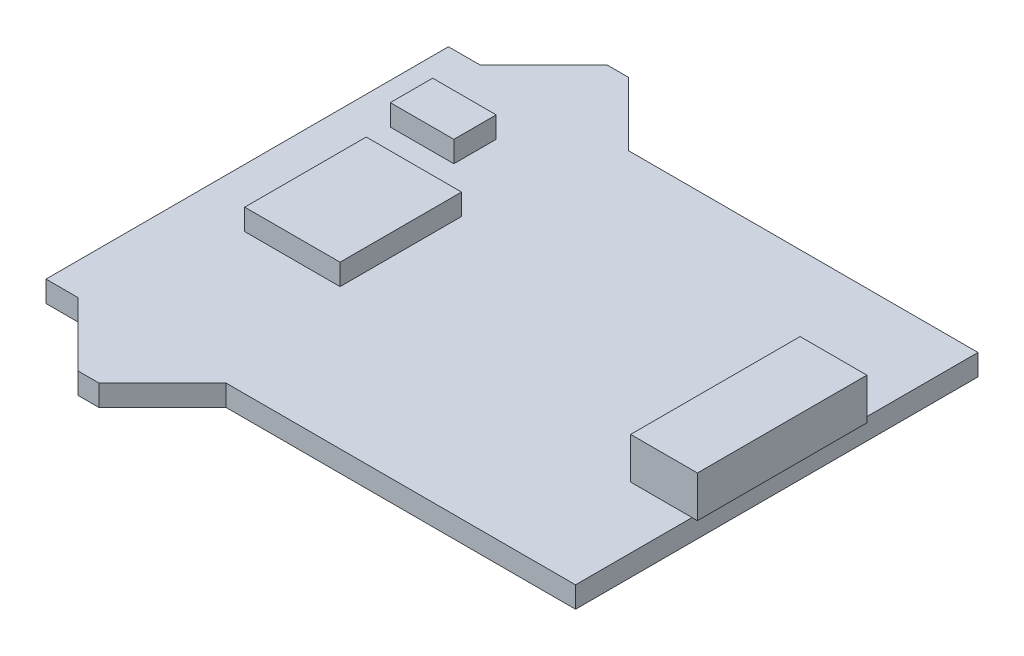
ISO-10303-21;
HEADER;
FILE_DESCRIPTION(('STEP AP214'),'2;1');
FILE_NAME('part.step','',(''),(''),'','','');
FILE_SCHEMA(('AUTOMOTIVE_DESIGN { 1 0 10303 214 1 1 1 1 }'));
ENDSEC;
DATA;
#1=APPLICATION_CONTEXT('core data for automotive mechanical design processes');
#2=APPLICATION_PROTOCOL_DEFINITION('international standard','automotive_design',2000,#1);
#3=PRODUCT_CONTEXT('',#1,'mechanical');
#4=PRODUCT('Part','Part','',(#3));
#5=PRODUCT_RELATED_PRODUCT_CATEGORY('part','',(#4));
#6=PRODUCT_DEFINITION_FORMATION('','',#4);
#7=PRODUCT_DEFINITION_CONTEXT('part definition',#1,'design');
#8=PRODUCT_DEFINITION('design','',#6,#7);
#9=PRODUCT_DEFINITION_SHAPE('','',#8);
#10=(LENGTH_UNIT() NAMED_UNIT(*) SI_UNIT(.MILLI.,.METRE.));
#11=(NAMED_UNIT(*) PLANE_ANGLE_UNIT() SI_UNIT($,.RADIAN.));
#12=(NAMED_UNIT(*) SI_UNIT($,.STERADIAN.) SOLID_ANGLE_UNIT());
#13=UNCERTAINTY_MEASURE_WITH_UNIT(LENGTH_MEASURE(1.E-05),#10,'distance_accuracy_value','');
#14=(GEOMETRIC_REPRESENTATION_CONTEXT(3) GLOBAL_UNCERTAINTY_ASSIGNED_CONTEXT((#13)) GLOBAL_UNIT_ASSIGNED_CONTEXT((#10,
#11,#12)) REPRESENTATION_CONTEXT('',''));
#15=CARTESIAN_POINT('',(0.,0.,0.));
#16=DIRECTION('',(0.,0.,1.));
#17=DIRECTION('',(1.,0.,0.));
#18=AXIS2_PLACEMENT_3D('',#15,#16,#17);
#19=CARTESIAN_POINT('',(0.,0.,0.));
#20=DIRECTION('',(0.,-1.,0.));
#21=DIRECTION('',(0.,0.,-1.));
#22=AXIS2_PLACEMENT_3D('',#19,#20,#21);
#23=PLANE('',#22);
#24=DIRECTION('',(0.,0.,-1.));
#25=VECTOR('',#24,1.);
#26=CARTESIAN_POINT('',(-0.0875000000000005,0.,-4.842));
#27=LINE('',#26,#25);
#28=CARTESIAN_POINT('',(-0.0875000000000005,0.,-4.842));
#29=VERTEX_POINT('',#28);
#30=CARTESIAN_POINT('',(-0.0875000000000008,0.,-6.842));
#31=VERTEX_POINT('',#30);
#32=EDGE_CURVE('E226',#29,#31,#27,.T.);
#33=ORIENTED_EDGE('',*,*,#32,.F.);
#34=DIRECTION('',(1.,0.,0.));
#35=VECTOR('',#34,1.);
#36=CARTESIAN_POINT('',(-3.0875,0.,-4.842));
#37=LINE('',#36,#35);
#38=CARTESIAN_POINT('',(-3.0875,0.,-4.842));
#39=VERTEX_POINT('',#38);
#40=EDGE_CURVE('E239',#39,#29,#37,.T.);
#41=ORIENTED_EDGE('',*,*,#40,.F.);
#42=DIRECTION('',(0.,0.,1.));
#43=VECTOR('',#42,1.);
#44=CARTESIAN_POINT('',(-3.0875,0.,-4.842));
#45=LINE('',#44,#43);
#46=CARTESIAN_POINT('',(-3.0875,0.,-6.842));
#47=VERTEX_POINT('',#46);
#48=EDGE_CURVE('E248',#47,#39,#45,.T.);
#49=ORIENTED_EDGE('',*,*,#48,.F.);
#50=DIRECTION('',(-1.,0.,0.));
#51=VECTOR('',#50,1.);
#52=CARTESIAN_POINT('',(-3.0875,0.,-6.842));
#53=LINE('',#52,#51);
#54=EDGE_CURVE('E229',#31,#47,#53,.T.);
#55=ORIENTED_EDGE('',*,*,#54,.F.);
#56=EDGE_LOOP('',(#33,#41,#49,#55));
#57=FACE_BOUND('',#56,.T.);
#58=DIRECTION('',(0.,0.,-1.));
#59=VECTOR('',#58,1.);
#60=CARTESIAN_POINT('',(2.249999945,0.,2.86760421207147));
#61=LINE('',#60,#59);
#62=CARTESIAN_POINT('',(2.249999945,0.,2.86760421207147));
#63=VERTEX_POINT('',#62);
#64=CARTESIAN_POINT('',(2.249999945,0.,-2.86760421207147));
#65=VERTEX_POINT('',#64);
#66=EDGE_CURVE('E264',#63,#65,#61,.T.);
#67=ORIENTED_EDGE('',*,*,#66,.F.);
#68=DIRECTION('',(1.,0.,0.));
#69=VECTOR('',#68,1.);
#70=CARTESIAN_POINT('',(-2.249999945,0.,2.86760421207147));
#71=LINE('',#70,#69);
#72=CARTESIAN_POINT('',(-2.249999945,0.,2.86760421207147));
#73=VERTEX_POINT('',#72);
#74=EDGE_CURVE('E269',#73,#63,#71,.T.);
#75=ORIENTED_EDGE('',*,*,#74,.F.);
#76=DIRECTION('',(0.,0.,1.));
#77=VECTOR('',#76,1.);
#78=CARTESIAN_POINT('',(-2.249999945,0.,2.86760421207147));
#79=LINE('',#78,#77);
#80=CARTESIAN_POINT('',(-2.249999945,0.,-2.86760421207147));
#81=VERTEX_POINT('',#80);
#82=EDGE_CURVE('E281',#81,#73,#79,.T.);
#83=ORIENTED_EDGE('',*,*,#82,.F.);
#84=DIRECTION('',(-1.,0.,0.));
#85=VECTOR('',#84,1.);
#86=CARTESIAN_POINT('',(-2.249999945,0.,-2.86760421207147));
#87=LINE('',#86,#85);
#88=EDGE_CURVE('E278',#65,#81,#87,.T.);
#89=ORIENTED_EDGE('',*,*,#88,.F.);
#90=EDGE_LOOP('',(#67,#75,#83,#89));
#91=FACE_BOUND('',#90,.T.);
#92=DIRECTION('',(1.,0.,0.));
#93=VECTOR('',#92,1.);
#94=CARTESIAN_POINT('',(17.10000009,0.,4.000000001));
#95=LINE('',#94,#93);
#96=CARTESIAN_POINT('',(17.10000009,0.,4.000000001));
#97=VERTEX_POINT('',#96);
#98=CARTESIAN_POINT('',(20.000000132,0.,4.000000001));
#99=VERTEX_POINT('',#98);
#100=EDGE_CURVE('E50',#97,#99,#95,.T.);
#101=ORIENTED_EDGE('',*,*,#100,.F.);
#102=DIRECTION('',(0.,0.,1.));
#103=VECTOR('',#102,1.);
#104=CARTESIAN_POINT('',(17.10000009,0.,4.000000001));
#105=LINE('',#104,#103);
#106=CARTESIAN_POINT('',(17.10000009,0.,-4.000000001));
#107=VERTEX_POINT('',#106);
#108=EDGE_CURVE('E54',#107,#97,#105,.T.);
#109=ORIENTED_EDGE('',*,*,#108,.F.);
#110=DIRECTION('',(-1.,0.,0.));
#111=VECTOR('',#110,1.);
#112=CARTESIAN_POINT('',(17.10000009,0.,-4.000000001));
#113=LINE('',#112,#111);
#114=CARTESIAN_POINT('',(20.000000132,0.,-4.000000001));
#115=VERTEX_POINT('',#114);
#116=EDGE_CURVE('E395',#115,#107,#113,.T.);
#117=ORIENTED_EDGE('',*,*,#116,.F.);
#118=DIRECTION('',(0.,0.,-1.));
#119=VECTOR('',#118,1.);
#120=CARTESIAN_POINT('',(20.000000132,0.,-9.50000005));
#121=LINE('',#120,#119);
#122=CARTESIAN_POINT('',(20.000000132,0.,-9.50000005));
#123=VERTEX_POINT('',#122);
#124=EDGE_CURVE('E365',#115,#123,#121,.T.);
#125=ORIENTED_EDGE('',*,*,#124,.T.);
#126=DIRECTION('',(-1.,0.,0.));
#127=VECTOR('',#126,1.);
#128=CARTESIAN_POINT('',(3.499999985,0.,-9.50000005));
#129=LINE('',#128,#127);
#130=CARTESIAN_POINT('',(3.499999985,0.,-9.50000005));
#131=VERTEX_POINT('',#130);
#132=EDGE_CURVE('E297',#123,#131,#129,.T.);
#133=ORIENTED_EDGE('',*,*,#132,.T.);
#134=DIRECTION('',(-0.707106781186547,0.,-0.707106781186547));
#135=VECTOR('',#134,1.);
#136=CARTESIAN_POINT('',(0.499999888999999,0.,-12.500000146));
#137=LINE('',#136,#135);
#138=CARTESIAN_POINT('',(0.499999888999999,0.,-12.500000146));
#139=VERTEX_POINT('',#138);
#140=EDGE_CURVE('E335',#131,#139,#137,.T.);
#141=ORIENTED_EDGE('',*,*,#140,.T.);
#142=DIRECTION('',(-1.,0.,0.));
#143=VECTOR('',#142,1.);
#144=CARTESIAN_POINT('',(-0.499999888999999,0.,-12.500000146));
#145=LINE('',#144,#143);
#146=CARTESIAN_POINT('',(-0.499999888999999,0.,-12.500000146));
#147=VERTEX_POINT('',#146);
#148=EDGE_CURVE('E338',#139,#147,#145,.T.);
#149=ORIENTED_EDGE('',*,*,#148,.T.);
#150=DIRECTION('',(-0.707106781186547,0.,0.707106781186547));
#151=VECTOR('',#150,1.);
#152=CARTESIAN_POINT('',(-3.499999985,0.,-9.50000005));
#153=LINE('',#152,#151);
#154=CARTESIAN_POINT('',(-3.499999985,0.,-9.50000005));
#155=VERTEX_POINT('',#154);
#156=EDGE_CURVE('E341',#147,#155,#153,.T.);
#157=ORIENTED_EDGE('',*,*,#156,.T.);
#158=DIRECTION('',(-1.,0.,0.));
#159=VECTOR('',#158,1.);
#160=CARTESIAN_POINT('',(-4.999999906,0.,-9.50000005));
#161=LINE('',#160,#159);
#162=CARTESIAN_POINT('',(-4.999999906,0.,-9.50000005));
#163=VERTEX_POINT('',#162);
#164=EDGE_CURVE('E344',#155,#163,#161,.T.);
#165=ORIENTED_EDGE('',*,*,#164,.T.);
#166=DIRECTION('',(0.,0.,1.));
#167=VECTOR('',#166,1.);
#168=CARTESIAN_POINT('',(-4.999999906,0.,-9.50000005));
#169=LINE('',#168,#167);
#170=CARTESIAN_POINT('',(-4.999999906,0.,9.50000005));
#171=VERTEX_POINT('',#170);
#172=EDGE_CURVE('E347',#163,#171,#169,.T.);
#173=ORIENTED_EDGE('',*,*,#172,.T.);
#174=DIRECTION('',(1.,0.,0.));
#175=VECTOR('',#174,1.);
#176=CARTESIAN_POINT('',(-4.999999906,0.,9.50000005));
#177=LINE('',#176,#175);
#178=CARTESIAN_POINT('',(-3.499999985,0.,9.50000005));
#179=VERTEX_POINT('',#178);
#180=EDGE_CURVE('E350',#171,#179,#177,.T.);
#181=ORIENTED_EDGE('',*,*,#180,.T.);
#182=DIRECTION('',(0.707106781186547,0.,0.707106781186547));
#183=VECTOR('',#182,1.);
#184=CARTESIAN_POINT('',(-3.499999985,0.,9.50000005));
#185=LINE('',#184,#183);
#186=CARTESIAN_POINT('',(-0.499999888999999,0.,12.500000146));
#187=VERTEX_POINT('',#186);
#188=EDGE_CURVE('E353',#179,#187,#185,.T.);
#189=ORIENTED_EDGE('',*,*,#188,.T.);
#190=DIRECTION('',(1.,0.,0.));
#191=VECTOR('',#190,1.);
#192=CARTESIAN_POINT('',(-0.499999888999999,0.,12.500000146));
#193=LINE('',#192,#191);
#194=CARTESIAN_POINT('',(0.499999888999999,0.,12.500000146));
#195=VERTEX_POINT('',#194);
#196=EDGE_CURVE('E356',#187,#195,#193,.T.);
#197=ORIENTED_EDGE('',*,*,#196,.T.);
#198=DIRECTION('',(0.707106781186547,0.,-0.707106781186547));
#199=VECTOR('',#198,1.);
#200=CARTESIAN_POINT('',(0.499999888999999,0.,12.500000146));
#201=LINE('',#200,#199);
#202=CARTESIAN_POINT('',(3.499999985,0.,9.50000005));
#203=VERTEX_POINT('',#202);
#204=EDGE_CURVE('E359',#195,#203,#201,.T.);
#205=ORIENTED_EDGE('',*,*,#204,.T.);
#206=DIRECTION('',(1.,0.,0.));
#207=VECTOR('',#206,1.);
#208=CARTESIAN_POINT('',(4.999999906,0.,9.50000005));
#209=LINE('',#208,#207);
#210=CARTESIAN_POINT('',(20.000000132,0.,9.50000005));
#211=VERTEX_POINT('',#210);
#212=EDGE_CURVE('E362',#203,#211,#209,.T.);
#213=ORIENTED_EDGE('',*,*,#212,.T.);
#214=EDGE_CURVE('E301',#211,#99,#121,.T.);
#215=ORIENTED_EDGE('',*,*,#214,.T.);
#216=EDGE_LOOP('',(#101,#109,#117,#125,#133,#141,#149,#157,#165,#173,#181,#189,#197,#205,#213,#215));
#217=FACE_BOUND('',#216,.T.);
#218=ADVANCED_FACE('F33',(#57,#91,#217),#23,.F.);
#219=CARTESIAN_POINT('',(20.000000132,-1.000000032,-9.50000005));
#220=DIRECTION('',(1.,0.,0.));
#221=DIRECTION('',(0.,0.,-1.));
#222=AXIS2_PLACEMENT_3D('',#219,#220,#221);
#223=PLANE('',#222);
#224=ORIENTED_EDGE('',*,*,#214,.F.);
#225=DIRECTION('',(0.,1.,0.));
#226=VECTOR('',#225,1.);
#227=CARTESIAN_POINT('',(20.000000132,-1.000000032,9.50000005));
#228=LINE('',#227,#226);
#229=CARTESIAN_POINT('',(20.000000132,-1.000000032,9.50000005));
#230=VERTEX_POINT('',#229);
#231=EDGE_CURVE('E42',#230,#211,#228,.T.);
#232=ORIENTED_EDGE('',*,*,#231,.F.);
#233=DIRECTION('',(0.,0.,-1.));
#234=VECTOR('',#233,1.);
#235=CARTESIAN_POINT('',(20.000000132,-1.000000032,-9.50000005));
#236=LINE('',#235,#234);
#237=CARTESIAN_POINT('',(20.000000132,-1.000000032,-9.50000005));
#238=VERTEX_POINT('',#237);
#239=EDGE_CURVE('E330',#230,#238,#236,.T.);
#240=ORIENTED_EDGE('',*,*,#239,.T.);
#241=DIRECTION('',(0.,1.,0.));
#242=VECTOR('',#241,1.);
#243=CARTESIAN_POINT('',(20.000000132,-1.000000032,-9.50000005));
#244=LINE('',#243,#242);
#245=EDGE_CURVE('E11',#238,#123,#244,.T.);
#246=ORIENTED_EDGE('',*,*,#245,.T.);
#247=ORIENTED_EDGE('',*,*,#124,.F.);
#248=EDGE_CURVE('E366',#99,#115,#121,.T.);
#249=ORIENTED_EDGE('',*,*,#248,.F.);
#250=EDGE_LOOP('',(#224,#232,#240,#246,#247,#249));
#251=FACE_BOUND('',#250,.T.);
#252=ADVANCED_FACE('F429',(#251),#223,.T.);
#253=CARTESIAN_POINT('',(4.999999906,-1.000000032,9.50000005));
#254=DIRECTION('',(0.,0.,1.));
#255=DIRECTION('',(1.,0.,0.));
#256=AXIS2_PLACEMENT_3D('',#253,#254,#255);
#257=PLANE('',#256);
#258=ORIENTED_EDGE('',*,*,#212,.F.);
#259=DIRECTION('',(0.,1.,0.));
#260=VECTOR('',#259,1.);
#261=CARTESIAN_POINT('',(3.499999985,-1.000000032,9.50000005));
#262=LINE('',#261,#260);
#263=CARTESIAN_POINT('',(3.499999985,-1.000000032,9.50000005));
#264=VERTEX_POINT('',#263);
#265=EDGE_CURVE('E369',#264,#203,#262,.T.);
#266=ORIENTED_EDGE('',*,*,#265,.F.);
#267=DIRECTION('',(1.,0.,0.));
#268=VECTOR('',#267,1.);
#269=CARTESIAN_POINT('',(3.499999985,-1.000000032,9.50000005));
#270=LINE('',#269,#268);
#271=EDGE_CURVE('E328',#264,#230,#270,.T.);
#272=ORIENTED_EDGE('',*,*,#271,.T.);
#273=ORIENTED_EDGE('',*,*,#231,.T.);
#274=EDGE_LOOP('',(#258,#266,#272,#273));
#275=FACE_BOUND('',#274,.T.);
#276=ADVANCED_FACE('F435',(#275),#257,.T.);
#277=CARTESIAN_POINT('',(0.499999888999999,-1.000000032,12.500000146));
#278=DIRECTION('',(0.707106781186547,0.,0.707106781186548));
#279=DIRECTION('',(0.707106781186548,0.,-0.707106781186547));
#280=AXIS2_PLACEMENT_3D('',#277,#278,#279);
#281=PLANE('',#280);
#282=ORIENTED_EDGE('',*,*,#204,.F.);
#283=DIRECTION('',(0.,1.,0.));
#284=VECTOR('',#283,1.);
#285=CARTESIAN_POINT('',(0.499999888999999,-1.000000032,12.500000146));
#286=LINE('',#285,#284);
#287=CARTESIAN_POINT('',(0.499999888999999,-1.000000032,12.500000146));
#288=VERTEX_POINT('',#287);
#289=EDGE_CURVE('E372',#288,#195,#286,.T.);
#290=ORIENTED_EDGE('',*,*,#289,.F.);
#291=DIRECTION('',(0.707106781186547,0.,-0.707106781186547));
#292=VECTOR('',#291,1.);
#293=CARTESIAN_POINT('',(0.499999888999999,-1.000000032,12.500000146));
#294=LINE('',#293,#292);
#295=EDGE_CURVE('E325',#288,#264,#294,.T.);
#296=ORIENTED_EDGE('',*,*,#295,.T.);
#297=ORIENTED_EDGE('',*,*,#265,.T.);
#298=EDGE_LOOP('',(#282,#290,#296,#297));
#299=FACE_BOUND('',#298,.T.);
#300=ADVANCED_FACE('F444',(#299),#281,.T.);
#301=CARTESIAN_POINT('',(-0.499999888999999,-1.000000032,12.500000146));
#302=DIRECTION('',(0.,0.,1.));
#303=DIRECTION('',(1.,0.,0.));
#304=AXIS2_PLACEMENT_3D('',#301,#302,#303);
#305=PLANE('',#304);
#306=ORIENTED_EDGE('',*,*,#196,.F.);
#307=DIRECTION('',(0.,1.,0.));
#308=VECTOR('',#307,1.);
#309=CARTESIAN_POINT('',(-0.499999888999999,-1.000000032,12.500000146));
#310=LINE('',#309,#308);
#311=CARTESIAN_POINT('',(-0.499999888999999,-1.000000032,12.500000146));
#312=VERTEX_POINT('',#311);
#313=EDGE_CURVE('E374',#312,#187,#310,.T.);
#314=ORIENTED_EDGE('',*,*,#313,.F.);
#315=DIRECTION('',(1.,0.,0.));
#316=VECTOR('',#315,1.);
#317=CARTESIAN_POINT('',(-0.499999888999999,-1.000000032,12.500000146));
#318=LINE('',#317,#316);
#319=EDGE_CURVE('E322',#312,#288,#318,.T.);
#320=ORIENTED_EDGE('',*,*,#319,.T.);
#321=ORIENTED_EDGE('',*,*,#289,.T.);
#322=EDGE_LOOP('',(#306,#314,#320,#321));
#323=FACE_BOUND('',#322,.T.);
#324=ADVANCED_FACE('F448',(#323),#305,.T.);
#325=CARTESIAN_POINT('',(-3.499999985,-1.000000032,9.50000005));
#326=DIRECTION('',(-0.707106781186547,0.,0.707106781186548));
#327=DIRECTION('',(0.707106781186548,0.,0.707106781186547));
#328=AXIS2_PLACEMENT_3D('',#325,#326,#327);
#329=PLANE('',#328);
#330=ORIENTED_EDGE('',*,*,#188,.F.);
#331=DIRECTION('',(0.,1.,0.));
#332=VECTOR('',#331,1.);
#333=CARTESIAN_POINT('',(-3.499999985,-1.000000032,9.50000005));
#334=LINE('',#333,#332);
#335=CARTESIAN_POINT('',(-3.499999985,-1.000000032,9.50000005));
#336=VERTEX_POINT('',#335);
#337=EDGE_CURVE('E376',#336,#179,#334,.T.);
#338=ORIENTED_EDGE('',*,*,#337,.F.);
#339=DIRECTION('',(0.707106781186547,0.,0.707106781186547));
#340=VECTOR('',#339,1.);
#341=CARTESIAN_POINT('',(-3.499999985,-1.000000032,9.50000005));
#342=LINE('',#341,#340);
#343=EDGE_CURVE('E319',#336,#312,#342,.T.);
#344=ORIENTED_EDGE('',*,*,#343,.T.);
#345=ORIENTED_EDGE('',*,*,#313,.T.);
#346=EDGE_LOOP('',(#330,#338,#344,#345));
#347=FACE_BOUND('',#346,.T.);
#348=ADVANCED_FACE('F452',(#347),#329,.T.);
#349=CARTESIAN_POINT('',(-4.999999906,-1.000000032,9.50000005));
#350=DIRECTION('',(0.,0.,1.));
#351=DIRECTION('',(1.,0.,0.));
#352=AXIS2_PLACEMENT_3D('',#349,#350,#351);
#353=PLANE('',#352);
#354=ORIENTED_EDGE('',*,*,#180,.F.);
#355=DIRECTION('',(0.,1.,0.));
#356=VECTOR('',#355,1.);
#357=CARTESIAN_POINT('',(-4.999999906,-1.000000032,9.50000005));
#358=LINE('',#357,#356);
#359=CARTESIAN_POINT('',(-4.999999906,-1.000000032,9.50000005));
#360=VERTEX_POINT('',#359);
#361=EDGE_CURVE('E378',#360,#171,#358,.T.);
#362=ORIENTED_EDGE('',*,*,#361,.F.);
#363=DIRECTION('',(1.,0.,0.));
#364=VECTOR('',#363,1.);
#365=CARTESIAN_POINT('',(-4.999999906,-1.000000032,9.50000005));
#366=LINE('',#365,#364);
#367=EDGE_CURVE('E316',#360,#336,#366,.T.);
#368=ORIENTED_EDGE('',*,*,#367,.T.);
#369=ORIENTED_EDGE('',*,*,#337,.T.);
#370=EDGE_LOOP('',(#354,#362,#368,#369));
#371=FACE_BOUND('',#370,.T.);
#372=ADVANCED_FACE('F456',(#371),#353,.T.);
#373=CARTESIAN_POINT('',(-4.999999906,-1.000000032,-9.50000005));
#374=DIRECTION('',(-1.,0.,0.));
#375=DIRECTION('',(0.,0.,1.));
#376=AXIS2_PLACEMENT_3D('',#373,#374,#375);
#377=PLANE('',#376);
#378=ORIENTED_EDGE('',*,*,#172,.F.);
#379=DIRECTION('',(0.,1.,0.));
#380=VECTOR('',#379,1.);
#381=CARTESIAN_POINT('',(-4.999999906,-1.000000032,-9.50000005));
#382=LINE('',#381,#380);
#383=CARTESIAN_POINT('',(-4.999999906,-1.000000032,-9.50000005));
#384=VERTEX_POINT('',#383);
#385=EDGE_CURVE('E380',#384,#163,#382,.T.);
#386=ORIENTED_EDGE('',*,*,#385,.F.);
#387=DIRECTION('',(0.,0.,1.));
#388=VECTOR('',#387,1.);
#389=CARTESIAN_POINT('',(-4.999999906,-1.000000032,-9.50000005));
#390=LINE('',#389,#388);
#391=EDGE_CURVE('E313',#384,#360,#390,.T.);
#392=ORIENTED_EDGE('',*,*,#391,.T.);
#393=ORIENTED_EDGE('',*,*,#361,.T.);
#394=EDGE_LOOP('',(#378,#386,#392,#393));
#395=FACE_BOUND('',#394,.T.);
#396=ADVANCED_FACE('F460',(#395),#377,.T.);
#397=CARTESIAN_POINT('',(-4.999999906,-1.000000032,-9.50000005));
#398=DIRECTION('',(0.,0.,-1.));
#399=DIRECTION('',(-1.,0.,0.));
#400=AXIS2_PLACEMENT_3D('',#397,#398,#399);
#401=PLANE('',#400);
#402=ORIENTED_EDGE('',*,*,#164,.F.);
#403=DIRECTION('',(0.,1.,0.));
#404=VECTOR('',#403,1.);
#405=CARTESIAN_POINT('',(-3.499999985,-1.000000032,-9.50000005));
#406=LINE('',#405,#404);
#407=CARTESIAN_POINT('',(-3.499999985,-1.000000032,-9.50000005));
#408=VERTEX_POINT('',#407);
#409=EDGE_CURVE('E382',#408,#155,#406,.T.);
#410=ORIENTED_EDGE('',*,*,#409,.F.);
#411=DIRECTION('',(-1.,0.,0.));
#412=VECTOR('',#411,1.);
#413=CARTESIAN_POINT('',(-4.999999906,-1.000000032,-9.50000005));
#414=LINE('',#413,#412);
#415=EDGE_CURVE('E310',#408,#384,#414,.T.);
#416=ORIENTED_EDGE('',*,*,#415,.T.);
#417=ORIENTED_EDGE('',*,*,#385,.T.);
#418=EDGE_LOOP('',(#402,#410,#416,#417));
#419=FACE_BOUND('',#418,.T.);
#420=ADVANCED_FACE('F464',(#419),#401,.T.);
#421=CARTESIAN_POINT('',(-3.499999985,-1.000000032,-9.50000005));
#422=DIRECTION('',(-0.707106781186547,0.,-0.707106781186548));
#423=DIRECTION('',(-0.707106781186548,0.,0.707106781186547));
#424=AXIS2_PLACEMENT_3D('',#421,#422,#423);
#425=PLANE('',#424);
#426=ORIENTED_EDGE('',*,*,#156,.F.);
#427=DIRECTION('',(0.,1.,0.));
#428=VECTOR('',#427,1.);
#429=CARTESIAN_POINT('',(-0.499999888999999,-1.000000032,-12.500000146));
#430=LINE('',#429,#428);
#431=CARTESIAN_POINT('',(-0.499999888999999,-1.000000032,-12.500000146));
#432=VERTEX_POINT('',#431);
#433=EDGE_CURVE('E384',#432,#147,#430,.T.);
#434=ORIENTED_EDGE('',*,*,#433,.F.);
#435=DIRECTION('',(-0.707106781186547,0.,0.707106781186547));
#436=VECTOR('',#435,1.);
#437=CARTESIAN_POINT('',(-3.499999985,-1.000000032,-9.50000005));
#438=LINE('',#437,#436);
#439=EDGE_CURVE('E307',#432,#408,#438,.T.);
#440=ORIENTED_EDGE('',*,*,#439,.T.);
#441=ORIENTED_EDGE('',*,*,#409,.T.);
#442=EDGE_LOOP('',(#426,#434,#440,#441));
#443=FACE_BOUND('',#442,.T.);
#444=ADVANCED_FACE('F468',(#443),#425,.T.);
#445=CARTESIAN_POINT('',(-0.499999888999999,-1.000000032,-12.500000146));
#446=DIRECTION('',(0.,0.,-1.));
#447=DIRECTION('',(-1.,0.,0.));
#448=AXIS2_PLACEMENT_3D('',#445,#446,#447);
#449=PLANE('',#448);
#450=ORIENTED_EDGE('',*,*,#148,.F.);
#451=DIRECTION('',(0.,1.,0.));
#452=VECTOR('',#451,1.);
#453=CARTESIAN_POINT('',(0.499999888999999,-1.000000032,-12.500000146));
#454=LINE('',#453,#452);
#455=CARTESIAN_POINT('',(0.499999888999999,-1.000000032,-12.500000146));
#456=VERTEX_POINT('',#455);
#457=EDGE_CURVE('E385',#456,#139,#454,.T.);
#458=ORIENTED_EDGE('',*,*,#457,.F.);
#459=DIRECTION('',(-1.,0.,0.));
#460=VECTOR('',#459,1.);
#461=CARTESIAN_POINT('',(-0.499999888999999,-1.000000032,-12.500000146));
#462=LINE('',#461,#460);
#463=EDGE_CURVE('E304',#456,#432,#462,.T.);
#464=ORIENTED_EDGE('',*,*,#463,.T.);
#465=ORIENTED_EDGE('',*,*,#433,.T.);
#466=EDGE_LOOP('',(#450,#458,#464,#465));
#467=FACE_BOUND('',#466,.T.);
#468=ADVANCED_FACE('F472',(#467),#449,.T.);
#469=CARTESIAN_POINT('',(0.499999888999999,-1.000000032,-12.500000146));
#470=DIRECTION('',(0.707106781186547,0.,-0.707106781186548));
#471=DIRECTION('',(-0.707106781186548,0.,-0.707106781186547));
#472=AXIS2_PLACEMENT_3D('',#469,#470,#471);
#473=PLANE('',#472);
#474=ORIENTED_EDGE('',*,*,#140,.F.);
#475=DIRECTION('',(0.,1.,0.));
#476=VECTOR('',#475,1.);
#477=CARTESIAN_POINT('',(3.499999985,-1.000000032,-9.50000005));
#478=LINE('',#477,#476);
#479=CARTESIAN_POINT('',(3.499999985,-1.000000032,-9.50000005));
#480=VERTEX_POINT('',#479);
#481=EDGE_CURVE('E37',#480,#131,#478,.T.);
#482=ORIENTED_EDGE('',*,*,#481,.F.);
#483=DIRECTION('',(-0.707106781186547,0.,-0.707106781186547));
#484=VECTOR('',#483,1.);
#485=CARTESIAN_POINT('',(0.499999888999999,-1.000000032,-12.500000146));
#486=LINE('',#485,#484);
#487=EDGE_CURVE('E300',#480,#456,#486,.T.);
#488=ORIENTED_EDGE('',*,*,#487,.T.);
#489=ORIENTED_EDGE('',*,*,#457,.T.);
#490=EDGE_LOOP('',(#474,#482,#488,#489));
#491=FACE_BOUND('',#490,.T.);
#492=ADVANCED_FACE('F394',(#491),#473,.T.);
#493=CARTESIAN_POINT('',(3.499999985,-1.000000032,-9.50000005));
#494=DIRECTION('',(0.,0.,-1.));
#495=DIRECTION('',(-1.,0.,0.));
#496=AXIS2_PLACEMENT_3D('',#493,#494,#495);
#497=PLANE('',#496);
#498=ORIENTED_EDGE('',*,*,#132,.F.);
#499=ORIENTED_EDGE('',*,*,#245,.F.);
#500=DIRECTION('',(-1.,0.,0.));
#501=VECTOR('',#500,1.);
#502=CARTESIAN_POINT('',(4.999999906,-1.000000032,-9.50000005));
#503=LINE('',#502,#501);
#504=EDGE_CURVE('E298',#238,#480,#503,.T.);
#505=ORIENTED_EDGE('',*,*,#504,.T.);
#506=ORIENTED_EDGE('',*,*,#481,.T.);
#507=EDGE_LOOP('',(#498,#499,#505,#506));
#508=FACE_BOUND('',#507,.T.);
#509=ADVANCED_FACE('F35',(#508),#497,.T.);
#510=CARTESIAN_POINT('',(0.,-1.000000032,0.));
#511=DIRECTION('',(0.,-1.,0.));
#512=DIRECTION('',(0.,0.,-1.));
#513=AXIS2_PLACEMENT_3D('',#510,#511,#512);
#514=PLANE('',#513);
#515=ORIENTED_EDGE('',*,*,#504,.F.);
#516=ORIENTED_EDGE('',*,*,#239,.F.);
#517=ORIENTED_EDGE('',*,*,#271,.F.);
#518=ORIENTED_EDGE('',*,*,#295,.F.);
#519=ORIENTED_EDGE('',*,*,#319,.F.);
#520=ORIENTED_EDGE('',*,*,#343,.F.);
#521=ORIENTED_EDGE('',*,*,#367,.F.);
#522=ORIENTED_EDGE('',*,*,#391,.F.);
#523=ORIENTED_EDGE('',*,*,#415,.F.);
#524=ORIENTED_EDGE('',*,*,#439,.F.);
#525=ORIENTED_EDGE('',*,*,#463,.F.);
#526=ORIENTED_EDGE('',*,*,#487,.F.);
#527=EDGE_LOOP('',(#515,#516,#517,#518,#519,#520,#521,#522,#523,#524,#525,#526));
#528=FACE_BOUND('',#527,.T.);
#529=ADVANCED_FACE('F439',(#528),#514,.T.);
#530=CARTESIAN_POINT('',(2.249999945,1.,2.86760421207147));
#531=DIRECTION('',(-1.,0.,0.));
#532=DIRECTION('',(0.,0.,1.));
#533=AXIS2_PLACEMENT_3D('',#530,#531,#532);
#534=PLANE('',#533);
#535=ORIENTED_EDGE('',*,*,#66,.T.);
#536=DIRECTION('',(0.,-1.,0.));
#537=VECTOR('',#536,1.);
#538=CARTESIAN_POINT('',(2.249999945,1.,-2.86760421207147));
#539=LINE('',#538,#537);
#540=CARTESIAN_POINT('',(2.249999945,1.,-2.86760421207147));
#541=VERTEX_POINT('',#540);
#542=EDGE_CURVE('E294',#541,#65,#539,.T.);
#543=ORIENTED_EDGE('',*,*,#542,.F.);
#544=DIRECTION('',(0.,0.,-1.));
#545=VECTOR('',#544,1.);
#546=CARTESIAN_POINT('',(2.249999945,1.,2.86760421207147));
#547=LINE('',#546,#545);
#548=CARTESIAN_POINT('',(2.249999945,1.,2.86760421207147));
#549=VERTEX_POINT('',#548);
#550=EDGE_CURVE('E265',#549,#541,#547,.T.);
#551=ORIENTED_EDGE('',*,*,#550,.F.);
#552=DIRECTION('',(0.,-1.,0.));
#553=VECTOR('',#552,1.);
#554=CARTESIAN_POINT('',(2.249999945,1.,2.86760421207147));
#555=LINE('',#554,#553);
#556=EDGE_CURVE('E275',#549,#63,#555,.T.);
#557=ORIENTED_EDGE('',*,*,#556,.T.);
#558=EDGE_LOOP('',(#535,#543,#551,#557));
#559=FACE_BOUND('',#558,.T.);
#560=ADVANCED_FACE('F483',(#559),#534,.F.);
#561=CARTESIAN_POINT('',(-2.249999945,1.,-2.86760421207147));
#562=DIRECTION('',(0.,0.,1.));
#563=DIRECTION('',(1.,0.,0.));
#564=AXIS2_PLACEMENT_3D('',#561,#562,#563);
#565=PLANE('',#564);
#566=ORIENTED_EDGE('',*,*,#88,.T.);
#567=DIRECTION('',(0.,-1.,0.));
#568=VECTOR('',#567,1.);
#569=CARTESIAN_POINT('',(-2.249999945,1.,-2.86760421207147));
#570=LINE('',#569,#568);
#571=CARTESIAN_POINT('',(-2.249999945,1.,-2.86760421207147));
#572=VERTEX_POINT('',#571);
#573=EDGE_CURVE('E291',#572,#81,#570,.T.);
#574=ORIENTED_EDGE('',*,*,#573,.F.);
#575=DIRECTION('',(-1.,0.,0.));
#576=VECTOR('',#575,1.);
#577=CARTESIAN_POINT('',(-2.249999945,1.,-2.86760421207147));
#578=LINE('',#577,#576);
#579=EDGE_CURVE('E268',#541,#572,#578,.T.);
#580=ORIENTED_EDGE('',*,*,#579,.F.);
#581=ORIENTED_EDGE('',*,*,#542,.T.);
#582=EDGE_LOOP('',(#566,#574,#580,#581));
#583=FACE_BOUND('',#582,.T.);
#584=ADVANCED_FACE('F488',(#583),#565,.F.);
#585=CARTESIAN_POINT('',(-2.249999945,1.,2.86760421207147));
#586=DIRECTION('',(1.,0.,0.));
#587=DIRECTION('',(0.,0.,-1.));
#588=AXIS2_PLACEMENT_3D('',#585,#586,#587);
#589=PLANE('',#588);
#590=ORIENTED_EDGE('',*,*,#82,.T.);
#591=DIRECTION('',(0.,-1.,0.));
#592=VECTOR('',#591,1.);
#593=CARTESIAN_POINT('',(-2.249999945,1.,2.86760421207147));
#594=LINE('',#593,#592);
#595=CARTESIAN_POINT('',(-2.249999945,1.,2.86760421207147));
#596=VERTEX_POINT('',#595);
#597=EDGE_CURVE('E288',#596,#73,#594,.T.);
#598=ORIENTED_EDGE('',*,*,#597,.F.);
#599=DIRECTION('',(0.,0.,1.));
#600=VECTOR('',#599,1.);
#601=CARTESIAN_POINT('',(-2.249999945,1.,2.86760421207147));
#602=LINE('',#601,#600);
#603=EDGE_CURVE('E271',#572,#596,#602,.T.);
#604=ORIENTED_EDGE('',*,*,#603,.F.);
#605=ORIENTED_EDGE('',*,*,#573,.T.);
#606=EDGE_LOOP('',(#590,#598,#604,#605));
#607=FACE_BOUND('',#606,.T.);
#608=ADVANCED_FACE('F511',(#607),#589,.F.);
#609=CARTESIAN_POINT('',(-2.249999945,1.,2.86760421207147));
#610=DIRECTION('',(0.,0.,-1.));
#611=DIRECTION('',(-1.,0.,0.));
#612=AXIS2_PLACEMENT_3D('',#609,#610,#611);
#613=PLANE('',#612);
#614=ORIENTED_EDGE('',*,*,#74,.T.);
#615=ORIENTED_EDGE('',*,*,#556,.F.);
#616=DIRECTION('',(1.,0.,0.));
#617=VECTOR('',#616,1.);
#618=CARTESIAN_POINT('',(-2.249999945,1.,2.86760421207147));
#619=LINE('',#618,#617);
#620=EDGE_CURVE('E273',#596,#549,#619,.T.);
#621=ORIENTED_EDGE('',*,*,#620,.F.);
#622=ORIENTED_EDGE('',*,*,#597,.T.);
#623=EDGE_LOOP('',(#614,#615,#621,#622));
#624=FACE_BOUND('',#623,.T.);
#625=ADVANCED_FACE('F517',(#624),#613,.F.);
#626=CARTESIAN_POINT('',(0.,1.,0.));
#627=DIRECTION('',(0.,-1.,0.));
#628=DIRECTION('',(0.,0.,-1.));
#629=AXIS2_PLACEMENT_3D('',#626,#627,#628);
#630=PLANE('',#629);
#631=ORIENTED_EDGE('',*,*,#550,.T.);
#632=ORIENTED_EDGE('',*,*,#579,.T.);
#633=ORIENTED_EDGE('',*,*,#603,.T.);
#634=ORIENTED_EDGE('',*,*,#620,.T.);
#635=EDGE_LOOP('',(#631,#632,#633,#634));
#636=FACE_BOUND('',#635,.T.);
#637=ADVANCED_FACE('F521',(#636),#630,.F.);
#638=CARTESIAN_POINT('',(-0.0875000000000005,1.,-4.842));
#639=DIRECTION('',(-1.,0.,0.));
#640=DIRECTION('',(0.,0.,1.));
#641=AXIS2_PLACEMENT_3D('',#638,#639,#640);
#642=PLANE('',#641);
#643=ORIENTED_EDGE('',*,*,#32,.T.);
#644=DIRECTION('',(0.,-1.,0.));
#645=VECTOR('',#644,1.);
#646=CARTESIAN_POINT('',(-0.0875000000000008,1.,-6.842));
#647=LINE('',#646,#645);
#648=CARTESIAN_POINT('',(-0.0875000000000008,1.,-6.842));
#649=VERTEX_POINT('',#648);
#650=EDGE_CURVE('E261',#649,#31,#647,.T.);
#651=ORIENTED_EDGE('',*,*,#650,.F.);
#652=DIRECTION('',(0.,0.,-1.));
#653=VECTOR('',#652,1.);
#654=CARTESIAN_POINT('',(-0.0875000000000005,1.,-4.842));
#655=LINE('',#654,#653);
#656=CARTESIAN_POINT('',(-0.0875000000000005,1.,-4.842));
#657=VERTEX_POINT('',#656);
#658=EDGE_CURVE('E235',#657,#649,#655,.T.);
#659=ORIENTED_EDGE('',*,*,#658,.F.);
#660=DIRECTION('',(0.,-1.,0.));
#661=VECTOR('',#660,1.);
#662=CARTESIAN_POINT('',(-0.0875000000000005,1.,-4.842));
#663=LINE('',#662,#661);
#664=EDGE_CURVE('E244',#657,#29,#663,.T.);
#665=ORIENTED_EDGE('',*,*,#664,.T.);
#666=EDGE_LOOP('',(#643,#651,#659,#665));
#667=FACE_BOUND('',#666,.T.);
#668=ADVANCED_FACE('F525',(#667),#642,.F.);
#669=CARTESIAN_POINT('',(-3.0875,1.,-6.842));
#670=DIRECTION('',(0.,0.,1.));
#671=DIRECTION('',(1.,0.,0.));
#672=AXIS2_PLACEMENT_3D('',#669,#670,#671);
#673=PLANE('',#672);
#674=ORIENTED_EDGE('',*,*,#54,.T.);
#675=DIRECTION('',(0.,-1.,0.));
#676=VECTOR('',#675,1.);
#677=CARTESIAN_POINT('',(-3.0875,1.,-6.842));
#678=LINE('',#677,#676);
#679=CARTESIAN_POINT('',(-3.0875,1.,-6.842));
#680=VERTEX_POINT('',#679);
#681=EDGE_CURVE('E258',#680,#47,#678,.T.);
#682=ORIENTED_EDGE('',*,*,#681,.F.);
#683=DIRECTION('',(-1.,0.,0.));
#684=VECTOR('',#683,1.);
#685=CARTESIAN_POINT('',(-3.0875,1.,-6.842));
#686=LINE('',#685,#684);
#687=EDGE_CURVE('E238',#649,#680,#686,.T.);
#688=ORIENTED_EDGE('',*,*,#687,.F.);
#689=ORIENTED_EDGE('',*,*,#650,.T.);
#690=EDGE_LOOP('',(#674,#682,#688,#689));
#691=FACE_BOUND('',#690,.T.);
#692=ADVANCED_FACE('F529',(#691),#673,.F.);
#693=CARTESIAN_POINT('',(-3.0875,1.,-4.842));
#694=DIRECTION('',(1.,0.,0.));
#695=DIRECTION('',(0.,0.,-1.));
#696=AXIS2_PLACEMENT_3D('',#693,#694,#695);
#697=PLANE('',#696);
#698=ORIENTED_EDGE('',*,*,#48,.T.);
#699=DIRECTION('',(0.,-1.,0.));
#700=VECTOR('',#699,1.);
#701=CARTESIAN_POINT('',(-3.0875,1.,-4.842));
#702=LINE('',#701,#700);
#703=CARTESIAN_POINT('',(-3.0875,1.,-4.842));
#704=VERTEX_POINT('',#703);
#705=EDGE_CURVE('E255',#704,#39,#702,.T.);
#706=ORIENTED_EDGE('',*,*,#705,.F.);
#707=DIRECTION('',(0.,0.,1.));
#708=VECTOR('',#707,1.);
#709=CARTESIAN_POINT('',(-3.0875,1.,-4.842));
#710=LINE('',#709,#708);
#711=EDGE_CURVE('E241',#680,#704,#710,.T.);
#712=ORIENTED_EDGE('',*,*,#711,.F.);
#713=ORIENTED_EDGE('',*,*,#681,.T.);
#714=EDGE_LOOP('',(#698,#706,#712,#713));
#715=FACE_BOUND('',#714,.T.);
#716=ADVANCED_FACE('F533',(#715),#697,.F.);
#717=CARTESIAN_POINT('',(-3.0875,1.,-4.842));
#718=DIRECTION('',(0.,0.,-1.));
#719=DIRECTION('',(-1.,0.,0.));
#720=AXIS2_PLACEMENT_3D('',#717,#718,#719);
#721=PLANE('',#720);
#722=ORIENTED_EDGE('',*,*,#40,.T.);
#723=ORIENTED_EDGE('',*,*,#664,.F.);
#724=DIRECTION('',(1.,0.,0.));
#725=VECTOR('',#724,1.);
#726=CARTESIAN_POINT('',(-3.0875,1.,-4.842));
#727=LINE('',#726,#725);
#728=EDGE_CURVE('E243',#704,#657,#727,.T.);
#729=ORIENTED_EDGE('',*,*,#728,.F.);
#730=ORIENTED_EDGE('',*,*,#705,.T.);
#731=EDGE_LOOP('',(#722,#723,#729,#730));
#732=FACE_BOUND('',#731,.T.);
#733=ADVANCED_FACE('F537',(#732),#721,.F.);
#734=CARTESIAN_POINT('',(0.,1.,0.));
#735=DIRECTION('',(0.,-1.,0.));
#736=DIRECTION('',(0.,0.,-1.));
#737=AXIS2_PLACEMENT_3D('',#734,#735,#736);
#738=PLANE('',#737);
#739=ORIENTED_EDGE('',*,*,#658,.T.);
#740=ORIENTED_EDGE('',*,*,#687,.T.);
#741=ORIENTED_EDGE('',*,*,#711,.T.);
#742=ORIENTED_EDGE('',*,*,#728,.T.);
#743=EDGE_LOOP('',(#739,#740,#741,#742));
#744=FACE_BOUND('',#743,.T.);
#745=ADVANCED_FACE('F541',(#744),#738,.F.);
#746=CARTESIAN_POINT('',(17.10000009,1.94999991,4.000000001));
#747=DIRECTION('',(0.,0.,-1.));
#748=DIRECTION('',(-1.,0.,0.));
#749=AXIS2_PLACEMENT_3D('',#746,#747,#748);
#750=PLANE('',#749);
#751=ORIENTED_EDGE('',*,*,#100,.T.);
#752=CARTESIAN_POINT('',(20.254000132,0.,4.000000001));
#753=VERTEX_POINT('',#752);
#754=EDGE_CURVE('E224',#99,#753,#95,.T.);
#755=ORIENTED_EDGE('',*,*,#754,.T.);
#756=DIRECTION('',(0.,-1.,0.));
#757=VECTOR('',#756,1.);
#758=CARTESIAN_POINT('',(20.254000132,1.94999991,4.000000001));
#759=LINE('',#758,#757);
#760=CARTESIAN_POINT('',(20.254000132,1.94999991,4.000000001));
#761=VERTEX_POINT('',#760);
#762=EDGE_CURVE('E206',#761,#753,#759,.T.);
#763=ORIENTED_EDGE('',*,*,#762,.F.);
#764=DIRECTION('',(1.,0.,0.));
#765=VECTOR('',#764,1.);
#766=CARTESIAN_POINT('',(17.10000009,1.94999991,4.000000001));
#767=LINE('',#766,#765);
#768=CARTESIAN_POINT('',(17.10000009,1.94999991,4.000000001));
#769=VERTEX_POINT('',#768);
#770=EDGE_CURVE('E212',#769,#761,#767,.T.);
#771=ORIENTED_EDGE('',*,*,#770,.F.);
#772=DIRECTION('',(0.,-1.,0.));
#773=VECTOR('',#772,1.);
#774=CARTESIAN_POINT('',(17.10000009,1.94999991,4.000000001));
#775=LINE('',#774,#773);
#776=EDGE_CURVE('E414',#769,#97,#775,.T.);
#777=ORIENTED_EDGE('',*,*,#776,.T.);
#778=EDGE_LOOP('',(#751,#755,#763,#771,#777));
#779=FACE_BOUND('',#778,.T.);
#780=ADVANCED_FACE('F222',(#779),#750,.F.);
#781=CARTESIAN_POINT('',(20.254000132,1.94999991,4.000000001));
#782=DIRECTION('',(-1.,0.,0.));
#783=DIRECTION('',(0.,0.,1.));
#784=AXIS2_PLACEMENT_3D('',#781,#782,#783);
#785=PLANE('',#784);
#786=DIRECTION('',(0.,0.,-1.));
#787=VECTOR('',#786,1.);
#788=CARTESIAN_POINT('',(20.254000132,0.,4.000000001));
#789=LINE('',#788,#787);
#790=CARTESIAN_POINT('',(20.254000132,0.,-4.000000001));
#791=VERTEX_POINT('',#790);
#792=EDGE_CURVE('E410',#753,#791,#789,.T.);
#793=ORIENTED_EDGE('',*,*,#792,.T.);
#794=DIRECTION('',(0.,-1.,0.));
#795=VECTOR('',#794,1.);
#796=CARTESIAN_POINT('',(20.254000132,1.94999991,-4.000000001));
#797=LINE('',#796,#795);
#798=CARTESIAN_POINT('',(20.254000132,1.94999991,-4.000000001));
#799=VERTEX_POINT('',#798);
#800=EDGE_CURVE('E208',#799,#791,#797,.T.);
#801=ORIENTED_EDGE('',*,*,#800,.F.);
#802=DIRECTION('',(0.,0.,-1.));
#803=VECTOR('',#802,1.);
#804=CARTESIAN_POINT('',(20.254000132,1.94999991,4.000000001));
#805=LINE('',#804,#803);
#806=EDGE_CURVE('E202',#761,#799,#805,.T.);
#807=ORIENTED_EDGE('',*,*,#806,.F.);
#808=ORIENTED_EDGE('',*,*,#762,.T.);
#809=EDGE_LOOP('',(#793,#801,#807,#808));
#810=FACE_BOUND('',#809,.T.);
#811=ADVANCED_FACE('F204',(#810),#785,.F.);
#812=CARTESIAN_POINT('',(17.10000009,1.94999991,-4.000000001));
#813=DIRECTION('',(0.,0.,1.));
#814=DIRECTION('',(1.,0.,0.));
#815=AXIS2_PLACEMENT_3D('',#812,#813,#814);
#816=PLANE('',#815);
#817=EDGE_CURVE('E402',#791,#115,#113,.T.);
#818=ORIENTED_EDGE('',*,*,#817,.T.);
#819=ORIENTED_EDGE('',*,*,#116,.T.);
#820=DIRECTION('',(0.,-1.,0.));
#821=VECTOR('',#820,1.);
#822=CARTESIAN_POINT('',(17.10000009,1.94999991,-4.000000001));
#823=LINE('',#822,#821);
#824=CARTESIAN_POINT('',(17.10000009,1.94999991,-4.000000001));
#825=VERTEX_POINT('',#824);
#826=EDGE_CURVE('E231',#825,#107,#823,.T.);
#827=ORIENTED_EDGE('',*,*,#826,.F.);
#828=DIRECTION('',(-1.,0.,0.));
#829=VECTOR('',#828,1.);
#830=CARTESIAN_POINT('',(17.10000009,1.94999991,-4.000000001));
#831=LINE('',#830,#829);
#832=EDGE_CURVE('E211',#799,#825,#831,.T.);
#833=ORIENTED_EDGE('',*,*,#832,.F.);
#834=ORIENTED_EDGE('',*,*,#800,.T.);
#835=EDGE_LOOP('',(#818,#819,#827,#833,#834));
#836=FACE_BOUND('',#835,.T.);
#837=ADVANCED_FACE('F405',(#836),#816,.F.);
#838=CARTESIAN_POINT('',(17.10000009,1.94999991,4.000000001));
#839=DIRECTION('',(1.,0.,0.));
#840=DIRECTION('',(0.,0.,-1.));
#841=AXIS2_PLACEMENT_3D('',#838,#839,#840);
#842=PLANE('',#841);
#843=ORIENTED_EDGE('',*,*,#108,.T.);
#844=ORIENTED_EDGE('',*,*,#776,.F.);
#845=DIRECTION('',(0.,0.,1.));
#846=VECTOR('',#845,1.);
#847=CARTESIAN_POINT('',(17.10000009,1.94999991,4.000000001));
#848=LINE('',#847,#846);
#849=EDGE_CURVE('E217',#825,#769,#848,.T.);
#850=ORIENTED_EDGE('',*,*,#849,.F.);
#851=ORIENTED_EDGE('',*,*,#826,.T.);
#852=EDGE_LOOP('',(#843,#844,#850,#851));
#853=FACE_BOUND('',#852,.T.);
#854=ADVANCED_FACE('F416',(#853),#842,.F.);
#855=CARTESIAN_POINT('',(0.,1.94999991,0.));
#856=DIRECTION('',(0.,1.,0.));
#857=DIRECTION('',(0.,0.,1.));
#858=AXIS2_PLACEMENT_3D('',#855,#856,#857);
#859=PLANE('',#858);
#860=ORIENTED_EDGE('',*,*,#770,.T.);
#861=ORIENTED_EDGE('',*,*,#806,.T.);
#862=ORIENTED_EDGE('',*,*,#832,.T.);
#863=ORIENTED_EDGE('',*,*,#849,.T.);
#864=EDGE_LOOP('',(#860,#861,#862,#863));
#865=FACE_BOUND('',#864,.T.);
#866=ADVANCED_FACE('F215',(#865),#859,.T.);
#867=CARTESIAN_POINT('',(0.,0.,0.));
#868=DIRECTION('',(0.,1.,0.));
#869=DIRECTION('',(0.,0.,1.));
#870=AXIS2_PLACEMENT_3D('',#867,#868,#869);
#871=PLANE('',#870);
#872=ORIENTED_EDGE('',*,*,#248,.T.);
#873=ORIENTED_EDGE('',*,*,#817,.F.);
#874=ORIENTED_EDGE('',*,*,#792,.F.);
#875=ORIENTED_EDGE('',*,*,#754,.F.);
#876=EDGE_LOOP('',(#872,#873,#874,#875));
#877=FACE_BOUND('',#876,.T.);
#878=ADVANCED_FACE('F401',(#877),#871,.F.);
#879=CLOSED_SHELL('',(#218,#252,#276,#300,#324,#348,#372,#396,#420,#444,#468,#492,#509,#529,
#560,#584,#608,#625,#637,#668,#692,#716,#733,#745,#780,#811,#837,#854,#866,#878));
#880=MANIFOLD_SOLID_BREP('B2',#879);
#881=ADVANCED_BREP_SHAPE_REPRESENTATION('',(#18,#880),#14);
#882=SHAPE_DEFINITION_REPRESENTATION(#9,#881);
ENDSEC;
END-ISO-10303-21;
